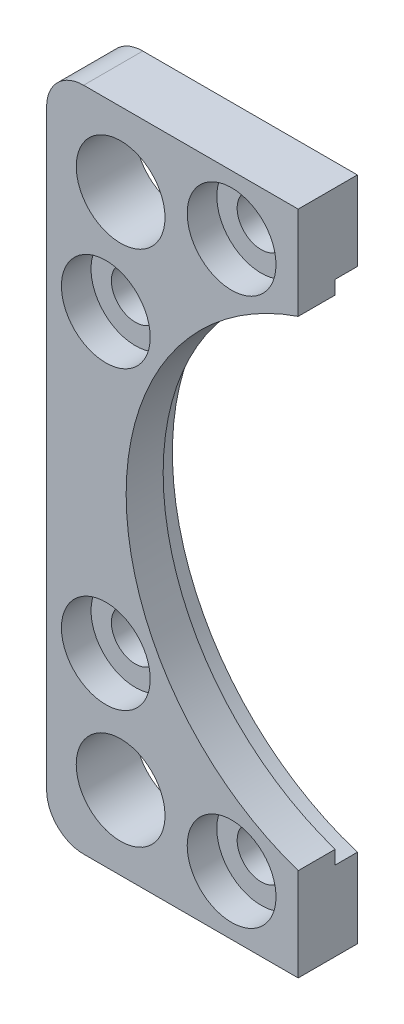
ISO-10303-21;
HEADER;
FILE_DESCRIPTION(('STEP AP214'),'2;1');
FILE_NAME('part.step','',(''),(''),'','','');
FILE_SCHEMA(('AUTOMOTIVE_DESIGN { 1 0 10303 214 1 1 1 1 }'));
ENDSEC;
DATA;
#1=APPLICATION_CONTEXT('core data for automotive mechanical design processes');
#2=APPLICATION_PROTOCOL_DEFINITION('international standard','automotive_design',2000,#1);
#3=PRODUCT_CONTEXT('',#1,'mechanical');
#4=PRODUCT('Part','Part','',(#3));
#5=PRODUCT_RELATED_PRODUCT_CATEGORY('part','',(#4));
#6=PRODUCT_DEFINITION_FORMATION('','',#4);
#7=PRODUCT_DEFINITION_CONTEXT('part definition',#1,'design');
#8=PRODUCT_DEFINITION('design','',#6,#7);
#9=PRODUCT_DEFINITION_SHAPE('','',#8);
#10=(LENGTH_UNIT() NAMED_UNIT(*) SI_UNIT(.MILLI.,.METRE.));
#11=(NAMED_UNIT(*) PLANE_ANGLE_UNIT() SI_UNIT($,.RADIAN.));
#12=(NAMED_UNIT(*) SI_UNIT($,.STERADIAN.) SOLID_ANGLE_UNIT());
#13=UNCERTAINTY_MEASURE_WITH_UNIT(LENGTH_MEASURE(1.E-05),#10,'distance_accuracy_value','');
#14=(GEOMETRIC_REPRESENTATION_CONTEXT(3) GLOBAL_UNCERTAINTY_ASSIGNED_CONTEXT((#13)) GLOBAL_UNIT_ASSIGNED_CONTEXT((#10,
#11,#12)) REPRESENTATION_CONTEXT('',''));
#15=CARTESIAN_POINT('',(0.,0.,0.));
#16=DIRECTION('',(0.,0.,1.));
#17=DIRECTION('',(1.,0.,0.));
#18=AXIS2_PLACEMENT_3D('',#15,#16,#17);
#19=CARTESIAN_POINT('',(-37.,20.,4.));
#20=DIRECTION('',(0.,0.,-1.));
#21=DIRECTION('',(-1.,0.,0.));
#22=AXIS2_PLACEMENT_3D('',#19,#20,#21);
#23=CYLINDRICAL_SURFACE('',#22,3.25);
#24=CARTESIAN_POINT('',(-37.,20.,-4.));
#25=DIRECTION('',(0.,0.,1.));
#26=DIRECTION('',(1.,0.,0.));
#27=AXIS2_PLACEMENT_3D('',#24,#25,#26);
#28=CIRCLE('',#27,3.25);
#29=CARTESIAN_POINT('',(-33.75,20.,-4.));
#30=VERTEX_POINT('',#29);
#31=EDGE_CURVE('E237',#30,#30,#28,.T.);
#32=ORIENTED_EDGE('',*,*,#31,.F.);
#33=EDGE_LOOP('',(#32));
#34=FACE_BOUND('',#33,.T.);
#35=CARTESIAN_POINT('',(-37.,20.,0.));
#36=DIRECTION('',(0.,0.,1.));
#37=DIRECTION('',(1.,0.,0.));
#38=AXIS2_PLACEMENT_3D('',#35,#36,#37);
#39=CIRCLE('',#38,3.25);
#40=CARTESIAN_POINT('',(-33.75,20.,0.));
#41=VERTEX_POINT('',#40);
#42=EDGE_CURVE('E38',#41,#41,#39,.T.);
#43=ORIENTED_EDGE('',*,*,#42,.T.);
#44=EDGE_LOOP('',(#43));
#45=FACE_BOUND('',#44,.T.);
#46=ADVANCED_FACE('F34',(#34,#45),#23,.F.);
#47=CARTESIAN_POINT('',(-20.,36.9999999999999,4.));
#48=DIRECTION('',(0.,0.,-1.));
#49=DIRECTION('',(-1.,0.,0.));
#50=AXIS2_PLACEMENT_3D('',#47,#48,#49);
#51=CYLINDRICAL_SURFACE('',#50,3.25);
#52=CARTESIAN_POINT('',(-20.,36.9999999999999,-4.));
#53=DIRECTION('',(0.,0.,1.));
#54=DIRECTION('',(1.,0.,0.));
#55=AXIS2_PLACEMENT_3D('',#52,#53,#54);
#56=CIRCLE('',#55,3.25);
#57=CARTESIAN_POINT('',(-16.75,36.9999999999999,-4.));
#58=VERTEX_POINT('',#57);
#59=EDGE_CURVE('E231',#58,#58,#56,.T.);
#60=ORIENTED_EDGE('',*,*,#59,.F.);
#61=EDGE_LOOP('',(#60));
#62=FACE_BOUND('',#61,.T.);
#63=CARTESIAN_POINT('',(-20.,36.9999999999999,0.));
#64=DIRECTION('',(0.,0.,1.));
#65=DIRECTION('',(1.,0.,0.));
#66=AXIS2_PLACEMENT_3D('',#63,#64,#65);
#67=CIRCLE('',#66,3.25);
#68=CARTESIAN_POINT('',(-16.75,36.9999999999999,0.));
#69=VERTEX_POINT('',#68);
#70=EDGE_CURVE('E181',#69,#69,#67,.T.);
#71=ORIENTED_EDGE('',*,*,#70,.T.);
#72=EDGE_LOOP('',(#71));
#73=FACE_BOUND('',#72,.T.);
#74=ADVANCED_FACE('F301',(#62,#73),#51,.F.);
#75=CARTESIAN_POINT('',(0.,0.,4.));
#76=DIRECTION('',(0.,0.,-1.));
#77=DIRECTION('',(-1.,0.,0.));
#78=AXIS2_PLACEMENT_3D('',#75,#76,#77);
#79=CYLINDRICAL_SURFACE('',#78,34.25);
#80=CARTESIAN_POINT('',(0.,0.,-1.));
#81=DIRECTION('',(0.,0.,-1.));
#82=DIRECTION('',(-1.,0.,0.));
#83=AXIS2_PLACEMENT_3D('',#80,#81,#82);
#84=CIRCLE('',#83,34.25);
#85=CARTESIAN_POINT('',(-11.,32.4355129449189,-1.));
#86=VERTEX_POINT('',#85);
#87=CARTESIAN_POINT('',(-11.,-32.4355129449189,-1.));
#88=VERTEX_POINT('',#87);
#89=EDGE_CURVE('E222',#86,#88,#84,.F.);
#90=ORIENTED_EDGE('',*,*,#89,.F.);
#91=DIRECTION('',(0.,0.,-1.));
#92=VECTOR('',#91,1.);
#93=CARTESIAN_POINT('',(-11.,32.4355129449189,4.));
#94=LINE('',#93,#92);
#95=CARTESIAN_POINT('',(-11.,32.4355129449189,4.));
#96=VERTEX_POINT('',#95);
#97=EDGE_CURVE('E155',#96,#86,#94,.T.);
#98=ORIENTED_EDGE('',*,*,#97,.F.);
#99=CARTESIAN_POINT('',(0.,0.,4.));
#100=DIRECTION('',(0.,0.,-1.));
#101=DIRECTION('',(1.,0.,0.));
#102=AXIS2_PLACEMENT_3D('',#99,#100,#101);
#103=CIRCLE('',#102,34.25);
#104=CARTESIAN_POINT('',(-11.,-32.4355129449189,4.));
#105=VERTEX_POINT('',#104);
#106=EDGE_CURVE('E255',#105,#96,#103,.T.);
#107=ORIENTED_EDGE('',*,*,#106,.F.);
#108=DIRECTION('',(0.,0.,-1.));
#109=VECTOR('',#108,1.);
#110=CARTESIAN_POINT('',(-11.,-32.4355129449189,4.));
#111=LINE('',#110,#109);
#112=EDGE_CURVE('E158',#105,#88,#111,.T.);
#113=ORIENTED_EDGE('',*,*,#112,.T.);
#114=EDGE_LOOP('',(#90,#98,#107,#113));
#115=FACE_BOUND('',#114,.T.);
#116=ADVANCED_FACE('F288',(#115),#79,.F.);
#117=CARTESIAN_POINT('',(0.,0.,4.));
#118=DIRECTION('',(0.,0.,1.));
#119=DIRECTION('',(1.,0.,0.));
#120=AXIS2_PLACEMENT_3D('',#117,#118,#119);
#121=PLANE('',#120);
#122=CARTESIAN_POINT('',(-20.,36.9999999999999,4.));
#123=DIRECTION('',(0.,0.,1.));
#124=DIRECTION('',(1.,0.,0.));
#125=AXIS2_PLACEMENT_3D('',#122,#123,#124);
#126=CIRCLE('',#125,6.);
#127=CARTESIAN_POINT('',(-14.,36.9999999999999,4.));
#128=VERTEX_POINT('',#127);
#129=EDGE_CURVE('E201',#128,#128,#126,.T.);
#130=ORIENTED_EDGE('',*,*,#129,.F.);
#131=EDGE_LOOP('',(#130));
#132=FACE_BOUND('',#131,.T.);
#133=CARTESIAN_POINT('',(-37.,20.,4.));
#134=DIRECTION('',(0.,0.,1.));
#135=DIRECTION('',(1.,0.,0.));
#136=AXIS2_PLACEMENT_3D('',#133,#134,#135);
#137=CIRCLE('',#136,6.);
#138=CARTESIAN_POINT('',(-31.,20.,4.));
#139=VERTEX_POINT('',#138);
#140=EDGE_CURVE('E202',#139,#139,#137,.T.);
#141=ORIENTED_EDGE('',*,*,#140,.F.);
#142=EDGE_LOOP('',(#141));
#143=FACE_BOUND('',#142,.T.);
#144=CARTESIAN_POINT('',(-37.,-20.,4.));
#145=DIRECTION('',(0.,0.,1.));
#146=DIRECTION('',(-1.,0.,0.));
#147=AXIS2_PLACEMENT_3D('',#144,#145,#146);
#148=CIRCLE('',#147,6.);
#149=CARTESIAN_POINT('',(-43.,-20.,4.));
#150=VERTEX_POINT('',#149);
#151=EDGE_CURVE('E213',#150,#150,#148,.T.);
#152=ORIENTED_EDGE('',*,*,#151,.F.);
#153=EDGE_LOOP('',(#152));
#154=FACE_BOUND('',#153,.T.);
#155=CARTESIAN_POINT('',(-20.,-36.9999999999999,4.));
#156=DIRECTION('',(0.,0.,1.));
#157=DIRECTION('',(-1.,0.,0.));
#158=AXIS2_PLACEMENT_3D('',#155,#156,#157);
#159=CIRCLE('',#158,6.);
#160=CARTESIAN_POINT('',(-26.,-36.9999999999999,4.));
#161=VERTEX_POINT('',#160);
#162=EDGE_CURVE('E219',#161,#161,#159,.T.);
#163=ORIENTED_EDGE('',*,*,#162,.F.);
#164=EDGE_LOOP('',(#163));
#165=FACE_BOUND('',#164,.T.);
#166=CARTESIAN_POINT('',(-35.,35.,4.));
#167=DIRECTION('',(0.,0.,1.));
#168=DIRECTION('',(1.,0.,0.));
#169=AXIS2_PLACEMENT_3D('',#166,#167,#168);
#170=CIRCLE('',#169,6.);
#171=CARTESIAN_POINT('',(-29.,35.,4.));
#172=VERTEX_POINT('',#171);
#173=EDGE_CURVE('E247',#172,#172,#170,.T.);
#174=ORIENTED_EDGE('',*,*,#173,.F.);
#175=EDGE_LOOP('',(#174));
#176=FACE_BOUND('',#175,.T.);
#177=DIRECTION('',(0.,-1.,0.));
#178=VECTOR('',#177,1.);
#179=CARTESIAN_POINT('',(-45.,45.,4.));
#180=LINE('',#179,#178);
#181=CARTESIAN_POINT('',(-45.,40.,4.));
#182=VERTEX_POINT('',#181);
#183=CARTESIAN_POINT('',(-45.,-40.,4.));
#184=VERTEX_POINT('',#183);
#185=EDGE_CURVE('E156',#182,#184,#180,.T.);
#186=ORIENTED_EDGE('',*,*,#185,.T.);
#187=CARTESIAN_POINT('',(-40.,-40.,4.));
#188=DIRECTION('',(0.,0.,1.));
#189=DIRECTION('',(1.,0.,0.));
#190=AXIS2_PLACEMENT_3D('',#187,#188,#189);
#191=CIRCLE('',#190,5.);
#192=CARTESIAN_POINT('',(-40.,-45.,4.));
#193=VERTEX_POINT('',#192);
#194=EDGE_CURVE('E43',#184,#193,#191,.T.);
#195=ORIENTED_EDGE('',*,*,#194,.T.);
#196=DIRECTION('',(1.,0.,0.));
#197=VECTOR('',#196,1.);
#198=CARTESIAN_POINT('',(-45.,-45.,4.));
#199=LINE('',#198,#197);
#200=CARTESIAN_POINT('',(-11.,-45.,4.));
#201=VERTEX_POINT('',#200);
#202=EDGE_CURVE('E152',#193,#201,#199,.T.);
#203=ORIENTED_EDGE('',*,*,#202,.T.);
#204=DIRECTION('',(0.,1.,0.));
#205=VECTOR('',#204,1.);
#206=CARTESIAN_POINT('',(-11.,-45.,4.));
#207=LINE('',#206,#205);
#208=EDGE_CURVE('E253',#201,#105,#207,.T.);
#209=ORIENTED_EDGE('',*,*,#208,.T.);
#210=ORIENTED_EDGE('',*,*,#106,.T.);
#211=DIRECTION('',(0.,1.,0.));
#212=VECTOR('',#211,1.);
#213=CARTESIAN_POINT('',(-11.,45.,4.));
#214=LINE('',#213,#212);
#215=CARTESIAN_POINT('',(-11.,45.,4.));
#216=VERTEX_POINT('',#215);
#217=EDGE_CURVE('E257',#96,#216,#214,.T.);
#218=ORIENTED_EDGE('',*,*,#217,.T.);
#219=DIRECTION('',(-1.,0.,0.));
#220=VECTOR('',#219,1.);
#221=CARTESIAN_POINT('',(-11.,45.,4.));
#222=LINE('',#221,#220);
#223=CARTESIAN_POINT('',(-40.,45.,4.));
#224=VERTEX_POINT('',#223);
#225=EDGE_CURVE('E259',#216,#224,#222,.T.);
#226=ORIENTED_EDGE('',*,*,#225,.T.);
#227=CARTESIAN_POINT('',(-40.,40.,4.));
#228=DIRECTION('',(0.,0.,1.));
#229=DIRECTION('',(1.,0.,0.));
#230=AXIS2_PLACEMENT_3D('',#227,#228,#229);
#231=CIRCLE('',#230,5.);
#232=EDGE_CURVE('E175',#224,#182,#231,.T.);
#233=ORIENTED_EDGE('',*,*,#232,.T.);
#234=EDGE_LOOP('',(#186,#195,#203,#209,#210,#218,#226,#233));
#235=FACE_BOUND('',#234,.T.);
#236=CARTESIAN_POINT('',(-35.,-35.,4.));
#237=DIRECTION('',(0.,0.,1.));
#238=DIRECTION('',(-1.,0.,0.));
#239=AXIS2_PLACEMENT_3D('',#236,#237,#238);
#240=CIRCLE('',#239,6.);
#241=CARTESIAN_POINT('',(-41.,-35.,4.));
#242=VERTEX_POINT('',#241);
#243=EDGE_CURVE('E241',#242,#242,#240,.T.);
#244=ORIENTED_EDGE('',*,*,#243,.F.);
#245=EDGE_LOOP('',(#244));
#246=FACE_BOUND('',#245,.T.);
#247=ADVANCED_FACE('F273',(#132,#143,#154,#165,#176,#235,#246),#121,.T.);
#248=CARTESIAN_POINT('',(0.,0.,-4.));
#249=DIRECTION('',(0.,0.,1.));
#250=DIRECTION('',(1.,0.,0.));
#251=AXIS2_PLACEMENT_3D('',#248,#249,#250);
#252=PLANE('',#251);
#253=DIRECTION('',(1.,0.,0.));
#254=VECTOR('',#253,1.);
#255=CARTESIAN_POINT('',(-45.,-45.,-4.));
#256=LINE('',#255,#254);
#257=CARTESIAN_POINT('',(-40.,-45.,-4.));
#258=VERTEX_POINT('',#257);
#259=CARTESIAN_POINT('',(-11.,-45.,-4.));
#260=VERTEX_POINT('',#259);
#261=EDGE_CURVE('E147',#258,#260,#256,.T.);
#262=ORIENTED_EDGE('',*,*,#261,.F.);
#263=CARTESIAN_POINT('',(-40.,-40.,-4.));
#264=DIRECTION('',(0.,0.,1.));
#265=DIRECTION('',(1.,0.,0.));
#266=AXIS2_PLACEMENT_3D('',#263,#264,#265);
#267=CIRCLE('',#266,5.);
#268=CARTESIAN_POINT('',(-45.,-40.,-4.));
#269=VERTEX_POINT('',#268);
#270=EDGE_CURVE('E169',#258,#269,#267,.F.);
#271=ORIENTED_EDGE('',*,*,#270,.T.);
#272=DIRECTION('',(0.,-1.,0.));
#273=VECTOR('',#272,1.);
#274=CARTESIAN_POINT('',(-45.,45.,-4.));
#275=LINE('',#274,#273);
#276=CARTESIAN_POINT('',(-45.,40.,-4.));
#277=VERTEX_POINT('',#276);
#278=EDGE_CURVE('E145',#277,#269,#275,.T.);
#279=ORIENTED_EDGE('',*,*,#278,.F.);
#280=CARTESIAN_POINT('',(-40.,40.,-4.));
#281=DIRECTION('',(0.,0.,1.));
#282=DIRECTION('',(1.,0.,0.));
#283=AXIS2_PLACEMENT_3D('',#280,#281,#282);
#284=CIRCLE('',#283,5.);
#285=CARTESIAN_POINT('',(-40.,45.,-4.));
#286=VERTEX_POINT('',#285);
#287=EDGE_CURVE('E167',#277,#286,#284,.F.);
#288=ORIENTED_EDGE('',*,*,#287,.T.);
#289=DIRECTION('',(-1.,0.,0.));
#290=VECTOR('',#289,1.);
#291=CARTESIAN_POINT('',(-11.,45.,-4.));
#292=LINE('',#291,#290);
#293=CARTESIAN_POINT('',(-11.,45.,-4.));
#294=VERTEX_POINT('',#293);
#295=EDGE_CURVE('E142',#294,#286,#292,.T.);
#296=ORIENTED_EDGE('',*,*,#295,.F.);
#297=DIRECTION('',(0.,1.,0.));
#298=VECTOR('',#297,1.);
#299=CARTESIAN_POINT('',(-11.,45.,-4.));
#300=LINE('',#299,#298);
#301=CARTESIAN_POINT('',(-11.,34.2782730020052,-4.));
#302=VERTEX_POINT('',#301);
#303=EDGE_CURVE('E132',#302,#294,#300,.T.);
#304=ORIENTED_EDGE('',*,*,#303,.F.);
#305=CARTESIAN_POINT('',(0.,0.,-4.));
#306=DIRECTION('',(0.,0.,-1.));
#307=DIRECTION('',(-1.,0.,0.));
#308=AXIS2_PLACEMENT_3D('',#305,#306,#307);
#309=CIRCLE('',#308,36.);
#310=CARTESIAN_POINT('',(-11.,-34.2782730020052,-4.));
#311=VERTEX_POINT('',#310);
#312=EDGE_CURVE('E115',#311,#302,#309,.T.);
#313=ORIENTED_EDGE('',*,*,#312,.F.);
#314=DIRECTION('',(0.,1.,0.));
#315=VECTOR('',#314,1.);
#316=CARTESIAN_POINT('',(-11.,-45.,-4.));
#317=LINE('',#316,#315);
#318=EDGE_CURVE('E143',#260,#311,#317,.T.);
#319=ORIENTED_EDGE('',*,*,#318,.F.);
#320=EDGE_LOOP('',(#262,#271,#279,#288,#296,#304,#313,#319));
#321=FACE_BOUND('',#320,.T.);
#322=CARTESIAN_POINT('',(-35.,35.,-4.));
#323=DIRECTION('',(0.,0.,1.));
#324=DIRECTION('',(1.,0.,0.));
#325=AXIS2_PLACEMENT_3D('',#322,#323,#324);
#326=CIRCLE('',#325,6.);
#327=CARTESIAN_POINT('',(-29.,35.,-4.));
#328=VERTEX_POINT('',#327);
#329=EDGE_CURVE('E244',#328,#328,#326,.T.);
#330=ORIENTED_EDGE('',*,*,#329,.T.);
#331=EDGE_LOOP('',(#330));
#332=FACE_BOUND('',#331,.T.);
#333=CARTESIAN_POINT('',(-35.,-35.,-4.));
#334=DIRECTION('',(0.,0.,1.));
#335=DIRECTION('',(-1.,0.,0.));
#336=AXIS2_PLACEMENT_3D('',#333,#334,#335);
#337=CIRCLE('',#336,6.);
#338=CARTESIAN_POINT('',(-41.,-35.,-4.));
#339=VERTEX_POINT('',#338);
#340=EDGE_CURVE('E240',#339,#339,#337,.T.);
#341=ORIENTED_EDGE('',*,*,#340,.T.);
#342=EDGE_LOOP('',(#341));
#343=FACE_BOUND('',#342,.T.);
#344=ORIENTED_EDGE('',*,*,#31,.T.);
#345=EDGE_LOOP('',(#344));
#346=FACE_BOUND('',#345,.T.);
#347=CARTESIAN_POINT('',(-37.,-20.,-4.));
#348=DIRECTION('',(0.,0.,1.));
#349=DIRECTION('',(-1.,0.,0.));
#350=AXIS2_PLACEMENT_3D('',#347,#348,#349);
#351=CIRCLE('',#350,3.25);
#352=CARTESIAN_POINT('',(-40.25,-20.,-4.));
#353=VERTEX_POINT('',#352);
#354=EDGE_CURVE('E234',#353,#353,#351,.T.);
#355=ORIENTED_EDGE('',*,*,#354,.T.);
#356=EDGE_LOOP('',(#355));
#357=FACE_BOUND('',#356,.T.);
#358=ORIENTED_EDGE('',*,*,#59,.T.);
#359=EDGE_LOOP('',(#358));
#360=FACE_BOUND('',#359,.T.);
#361=CARTESIAN_POINT('',(-20.,-36.9999999999999,-4.));
#362=DIRECTION('',(0.,0.,1.));
#363=DIRECTION('',(-1.,0.,0.));
#364=AXIS2_PLACEMENT_3D('',#361,#362,#363);
#365=CIRCLE('',#364,3.25);
#366=CARTESIAN_POINT('',(-23.25,-36.9999999999999,-4.));
#367=VERTEX_POINT('',#366);
#368=EDGE_CURVE('E228',#367,#367,#365,.T.);
#369=ORIENTED_EDGE('',*,*,#368,.T.);
#370=EDGE_LOOP('',(#369));
#371=FACE_BOUND('',#370,.T.);
#372=ADVANCED_FACE('F140',(#321,#332,#343,#346,#357,#360,#371),#252,.F.);
#373=CARTESIAN_POINT('',(-45.,-45.,4.));
#374=DIRECTION('',(0.,1.,0.));
#375=DIRECTION('',(0.,0.,1.));
#376=AXIS2_PLACEMENT_3D('',#373,#374,#375);
#377=PLANE('',#376);
#378=ORIENTED_EDGE('',*,*,#202,.F.);
#379=DIRECTION('',(0.,0.,-1.));
#380=VECTOR('',#379,1.);
#381=CARTESIAN_POINT('',(-40.,-45.,4.));
#382=LINE('',#381,#380);
#383=EDGE_CURVE('E136',#193,#258,#382,.T.);
#384=ORIENTED_EDGE('',*,*,#383,.T.);
#385=ORIENTED_EDGE('',*,*,#261,.T.);
#386=DIRECTION('',(0.,0.,-1.));
#387=VECTOR('',#386,1.);
#388=CARTESIAN_POINT('',(-11.,-45.,4.));
#389=LINE('',#388,#387);
#390=EDGE_CURVE('E161',#201,#260,#389,.T.);
#391=ORIENTED_EDGE('',*,*,#390,.F.);
#392=EDGE_LOOP('',(#378,#384,#385,#391));
#393=FACE_BOUND('',#392,.T.);
#394=ADVANCED_FACE('F264',(#393),#377,.F.);
#395=CARTESIAN_POINT('',(-11.,-45.,4.));
#396=DIRECTION('',(-1.,0.,0.));
#397=DIRECTION('',(0.,-1.,0.));
#398=AXIS2_PLACEMENT_3D('',#395,#396,#397);
#399=PLANE('',#398);
#400=ORIENTED_EDGE('',*,*,#318,.T.);
#401=DIRECTION('',(0.,0.,-1.));
#402=VECTOR('',#401,1.);
#403=CARTESIAN_POINT('',(-11.,-34.2782730020052,-1.));
#404=LINE('',#403,#402);
#405=CARTESIAN_POINT('',(-11.,-34.2782730020052,-1.));
#406=VERTEX_POINT('',#405);
#407=EDGE_CURVE('E122',#311,#406,#404,.F.);
#408=ORIENTED_EDGE('',*,*,#407,.T.);
#409=DIRECTION('',(0.,-1.,0.));
#410=VECTOR('',#409,1.);
#411=CARTESIAN_POINT('',(-11.,-45.,-1.));
#412=LINE('',#411,#410);
#413=EDGE_CURVE('E225',#88,#406,#412,.T.);
#414=ORIENTED_EDGE('',*,*,#413,.F.);
#415=ORIENTED_EDGE('',*,*,#112,.F.);
#416=ORIENTED_EDGE('',*,*,#208,.F.);
#417=ORIENTED_EDGE('',*,*,#390,.T.);
#418=EDGE_LOOP('',(#400,#408,#414,#415,#416,#417));
#419=FACE_BOUND('',#418,.T.);
#420=ADVANCED_FACE('F268',(#419),#399,.F.);
#421=CARTESIAN_POINT('',(-11.,45.,4.));
#422=DIRECTION('',(-1.,0.,0.));
#423=DIRECTION('',(0.,-1.,0.));
#424=AXIS2_PLACEMENT_3D('',#421,#422,#423);
#425=PLANE('',#424);
#426=DIRECTION('',(0.,-1.,0.));
#427=VECTOR('',#426,1.);
#428=CARTESIAN_POINT('',(-11.,45.,-1.));
#429=LINE('',#428,#427);
#430=CARTESIAN_POINT('',(-11.,34.2782730020052,-1.));
#431=VERTEX_POINT('',#430);
#432=EDGE_CURVE('E135',#431,#86,#429,.T.);
#433=ORIENTED_EDGE('',*,*,#432,.F.);
#434=DIRECTION('',(0.,0.,-1.));
#435=VECTOR('',#434,1.);
#436=CARTESIAN_POINT('',(-11.,34.2782730020052,-1.));
#437=LINE('',#436,#435);
#438=EDGE_CURVE('E119',#431,#302,#437,.T.);
#439=ORIENTED_EDGE('',*,*,#438,.T.);
#440=ORIENTED_EDGE('',*,*,#303,.T.);
#441=DIRECTION('',(0.,0.,-1.));
#442=VECTOR('',#441,1.);
#443=CARTESIAN_POINT('',(-11.,45.,4.));
#444=LINE('',#443,#442);
#445=EDGE_CURVE('E153',#216,#294,#444,.T.);
#446=ORIENTED_EDGE('',*,*,#445,.F.);
#447=ORIENTED_EDGE('',*,*,#217,.F.);
#448=ORIENTED_EDGE('',*,*,#97,.T.);
#449=EDGE_LOOP('',(#433,#439,#440,#446,#447,#448));
#450=FACE_BOUND('',#449,.T.);
#451=ADVANCED_FACE('F130',(#450),#425,.F.);
#452=CARTESIAN_POINT('',(-11.,45.,4.));
#453=DIRECTION('',(0.,-1.,0.));
#454=DIRECTION('',(0.,0.,-1.));
#455=AXIS2_PLACEMENT_3D('',#452,#453,#454);
#456=PLANE('',#455);
#457=ORIENTED_EDGE('',*,*,#295,.T.);
#458=DIRECTION('',(0.,0.,-1.));
#459=VECTOR('',#458,1.);
#460=CARTESIAN_POINT('',(-40.,45.,4.));
#461=LINE('',#460,#459);
#462=EDGE_CURVE('E11',#286,#224,#461,.F.);
#463=ORIENTED_EDGE('',*,*,#462,.T.);
#464=ORIENTED_EDGE('',*,*,#225,.F.);
#465=ORIENTED_EDGE('',*,*,#445,.T.);
#466=EDGE_LOOP('',(#457,#463,#464,#465));
#467=FACE_BOUND('',#466,.T.);
#468=ADVANCED_FACE('F284',(#467),#456,.F.);
#469=CARTESIAN_POINT('',(-45.,45.,4.));
#470=DIRECTION('',(1.,0.,0.));
#471=DIRECTION('',(0.,0.,-1.));
#472=AXIS2_PLACEMENT_3D('',#469,#470,#471);
#473=PLANE('',#472);
#474=ORIENTED_EDGE('',*,*,#278,.T.);
#475=DIRECTION('',(0.,0.,-1.));
#476=VECTOR('',#475,1.);
#477=CARTESIAN_POINT('',(-45.,-40.,4.));
#478=LINE('',#477,#476);
#479=EDGE_CURVE('E57',#269,#184,#478,.F.);
#480=ORIENTED_EDGE('',*,*,#479,.T.);
#481=ORIENTED_EDGE('',*,*,#185,.F.);
#482=DIRECTION('',(0.,0.,-1.));
#483=VECTOR('',#482,1.);
#484=CARTESIAN_POINT('',(-45.,40.,4.));
#485=LINE('',#484,#483);
#486=EDGE_CURVE('E171',#182,#277,#485,.T.);
#487=ORIENTED_EDGE('',*,*,#486,.T.);
#488=EDGE_LOOP('',(#474,#480,#481,#487));
#489=FACE_BOUND('',#488,.T.);
#490=ADVANCED_FACE('F280',(#489),#473,.F.);
#491=CARTESIAN_POINT('',(-35.,35.,4.));
#492=DIRECTION('',(0.,0.,-1.));
#493=DIRECTION('',(-1.,0.,0.));
#494=AXIS2_PLACEMENT_3D('',#491,#492,#493);
#495=CYLINDRICAL_SURFACE('',#494,6.);
#496=ORIENTED_EDGE('',*,*,#173,.T.);
#497=EDGE_LOOP('',(#496));
#498=FACE_BOUND('',#497,.T.);
#499=ORIENTED_EDGE('',*,*,#329,.F.);
#500=EDGE_LOOP('',(#499));
#501=FACE_BOUND('',#500,.T.);
#502=ADVANCED_FACE('F316',(#498,#501),#495,.F.);
#503=CARTESIAN_POINT('',(-35.,-35.,4.));
#504=DIRECTION('',(0.,0.,-1.));
#505=DIRECTION('',(-1.,0.,0.));
#506=AXIS2_PLACEMENT_3D('',#503,#504,#505);
#507=CYLINDRICAL_SURFACE('',#506,6.);
#508=ORIENTED_EDGE('',*,*,#243,.T.);
#509=EDGE_LOOP('',(#508));
#510=FACE_BOUND('',#509,.T.);
#511=ORIENTED_EDGE('',*,*,#340,.F.);
#512=EDGE_LOOP('',(#511));
#513=FACE_BOUND('',#512,.T.);
#514=ADVANCED_FACE('F313',(#510,#513),#507,.F.);
#515=CARTESIAN_POINT('',(-37.,-20.,4.));
#516=DIRECTION('',(0.,0.,-1.));
#517=DIRECTION('',(-1.,0.,0.));
#518=AXIS2_PLACEMENT_3D('',#515,#516,#517);
#519=CYLINDRICAL_SURFACE('',#518,3.25);
#520=CARTESIAN_POINT('',(-37.,-20.,0.));
#521=DIRECTION('',(0.,0.,-1.));
#522=DIRECTION('',(-1.,0.,0.));
#523=AXIS2_PLACEMENT_3D('',#520,#521,#522);
#524=CIRCLE('',#523,3.25);
#525=CARTESIAN_POINT('',(-40.25,-20.,0.));
#526=VERTEX_POINT('',#525);
#527=EDGE_CURVE('E184',#526,#526,#524,.T.);
#528=ORIENTED_EDGE('',*,*,#527,.F.);
#529=EDGE_LOOP('',(#528));
#530=FACE_BOUND('',#529,.T.);
#531=ORIENTED_EDGE('',*,*,#354,.F.);
#532=EDGE_LOOP('',(#531));
#533=FACE_BOUND('',#532,.T.);
#534=ADVANCED_FACE('F312',(#530,#533),#519,.F.);
#535=CARTESIAN_POINT('',(-20.,-36.9999999999999,4.));
#536=DIRECTION('',(0.,0.,-1.));
#537=DIRECTION('',(-1.,0.,0.));
#538=AXIS2_PLACEMENT_3D('',#535,#536,#537);
#539=CYLINDRICAL_SURFACE('',#538,3.25);
#540=CARTESIAN_POINT('',(-20.,-36.9999999999999,0.));
#541=DIRECTION('',(0.,0.,-1.));
#542=DIRECTION('',(-1.,0.,0.));
#543=AXIS2_PLACEMENT_3D('',#540,#541,#542);
#544=CIRCLE('',#543,3.25);
#545=CARTESIAN_POINT('',(-23.25,-36.9999999999999,0.));
#546=VERTEX_POINT('',#545);
#547=EDGE_CURVE('E178',#546,#546,#544,.T.);
#548=ORIENTED_EDGE('',*,*,#547,.F.);
#549=EDGE_LOOP('',(#548));
#550=FACE_BOUND('',#549,.T.);
#551=ORIENTED_EDGE('',*,*,#368,.F.);
#552=EDGE_LOOP('',(#551));
#553=FACE_BOUND('',#552,.T.);
#554=ADVANCED_FACE('F297',(#550,#553),#539,.F.);
#555=CARTESIAN_POINT('',(0.,0.,-1.));
#556=DIRECTION('',(0.,0.,-1.));
#557=DIRECTION('',(-1.,0.,0.));
#558=AXIS2_PLACEMENT_3D('',#555,#556,#557);
#559=CYLINDRICAL_SURFACE('',#558,36.);
#560=ORIENTED_EDGE('',*,*,#312,.T.);
#561=ORIENTED_EDGE('',*,*,#438,.F.);
#562=CARTESIAN_POINT('',(0.,0.,-1.));
#563=DIRECTION('',(0.,0.,-1.));
#564=DIRECTION('',(-1.,0.,0.));
#565=AXIS2_PLACEMENT_3D('',#562,#563,#564);
#566=CIRCLE('',#565,36.);
#567=EDGE_CURVE('E127',#406,#431,#566,.T.);
#568=ORIENTED_EDGE('',*,*,#567,.F.);
#569=ORIENTED_EDGE('',*,*,#407,.F.);
#570=EDGE_LOOP('',(#560,#561,#568,#569));
#571=FACE_BOUND('',#570,.T.);
#572=ADVANCED_FACE('F117',(#571),#559,.F.);
#573=CARTESIAN_POINT('',(0.,0.,-1.));
#574=DIRECTION('',(0.,0.,-1.));
#575=DIRECTION('',(-1.,0.,0.));
#576=AXIS2_PLACEMENT_3D('',#573,#574,#575);
#577=PLANE('',#576);
#578=ORIENTED_EDGE('',*,*,#413,.T.);
#579=ORIENTED_EDGE('',*,*,#567,.T.);
#580=ORIENTED_EDGE('',*,*,#432,.T.);
#581=ORIENTED_EDGE('',*,*,#89,.T.);
#582=EDGE_LOOP('',(#578,#579,#580,#581));
#583=FACE_BOUND('',#582,.T.);
#584=ADVANCED_FACE('F290',(#583),#577,.T.);
#585=CARTESIAN_POINT('',(-40.,-40.,4.));
#586=DIRECTION('',(0.,0.,-1.));
#587=DIRECTION('',(-1.,0.,0.));
#588=AXIS2_PLACEMENT_3D('',#585,#586,#587);
#589=CYLINDRICAL_SURFACE('',#588,5.);
#590=ORIENTED_EDGE('',*,*,#194,.F.);
#591=ORIENTED_EDGE('',*,*,#479,.F.);
#592=ORIENTED_EDGE('',*,*,#270,.F.);
#593=ORIENTED_EDGE('',*,*,#383,.F.);
#594=EDGE_LOOP('',(#590,#591,#592,#593));
#595=FACE_BOUND('',#594,.T.);
#596=ADVANCED_FACE('F278',(#595),#589,.T.);
#597=CARTESIAN_POINT('',(-40.,40.,4.));
#598=DIRECTION('',(0.,0.,-1.));
#599=DIRECTION('',(-1.,0.,0.));
#600=AXIS2_PLACEMENT_3D('',#597,#598,#599);
#601=CYLINDRICAL_SURFACE('',#600,5.);
#602=ORIENTED_EDGE('',*,*,#232,.F.);
#603=ORIENTED_EDGE('',*,*,#462,.F.);
#604=ORIENTED_EDGE('',*,*,#287,.F.);
#605=ORIENTED_EDGE('',*,*,#486,.F.);
#606=EDGE_LOOP('',(#602,#603,#604,#605));
#607=FACE_BOUND('',#606,.T.);
#608=ADVANCED_FACE('F36',(#607),#601,.T.);
#609=CARTESIAN_POINT('',(-20.,-36.9999999999999,0.));
#610=DIRECTION('',(0.,0.,1.));
#611=DIRECTION('',(1.,0.,0.));
#612=AXIS2_PLACEMENT_3D('',#609,#610,#611);
#613=CYLINDRICAL_SURFACE('',#612,6.);
#614=CARTESIAN_POINT('',(-20.,-36.9999999999999,0.));
#615=DIRECTION('',(0.,0.,1.));
#616=DIRECTION('',(-1.,0.,0.));
#617=AXIS2_PLACEMENT_3D('',#614,#615,#616);
#618=CIRCLE('',#617,6.);
#619=CARTESIAN_POINT('',(-26.,-36.9999999999999,0.));
#620=VERTEX_POINT('',#619);
#621=EDGE_CURVE('E216',#620,#620,#618,.T.);
#622=ORIENTED_EDGE('',*,*,#621,.F.);
#623=EDGE_LOOP('',(#622));
#624=FACE_BOUND('',#623,.T.);
#625=ORIENTED_EDGE('',*,*,#162,.T.);
#626=EDGE_LOOP('',(#625));
#627=FACE_BOUND('',#626,.T.);
#628=ADVANCED_FACE('F442',(#624,#627),#613,.F.);
#629=CARTESIAN_POINT('',(-20.,-36.9999999999999,0.));
#630=DIRECTION('',(0.,0.,-1.));
#631=DIRECTION('',(-1.,0.,0.));
#632=AXIS2_PLACEMENT_3D('',#629,#630,#631);
#633=PLANE('',#632);
#634=ORIENTED_EDGE('',*,*,#547,.T.);
#635=EDGE_LOOP('',(#634));
#636=FACE_BOUND('',#635,.T.);
#637=ORIENTED_EDGE('',*,*,#621,.T.);
#638=EDGE_LOOP('',(#637));
#639=FACE_BOUND('',#638,.T.);
#640=ADVANCED_FACE('F453',(#636,#639),#633,.F.);
#641=CARTESIAN_POINT('',(-20.,36.9999999999999,0.));
#642=DIRECTION('',(0.,0.,1.));
#643=DIRECTION('',(1.,0.,0.));
#644=AXIS2_PLACEMENT_3D('',#641,#642,#643);
#645=CYLINDRICAL_SURFACE('',#644,6.);
#646=CARTESIAN_POINT('',(-20.,36.9999999999999,0.));
#647=DIRECTION('',(0.,0.,1.));
#648=DIRECTION('',(1.,0.,0.));
#649=AXIS2_PLACEMENT_3D('',#646,#647,#648);
#650=CIRCLE('',#649,6.);
#651=CARTESIAN_POINT('',(-14.,36.9999999999999,0.));
#652=VERTEX_POINT('',#651);
#653=EDGE_CURVE('E182',#652,#652,#650,.T.);
#654=ORIENTED_EDGE('',*,*,#653,.F.);
#655=EDGE_LOOP('',(#654));
#656=FACE_BOUND('',#655,.T.);
#657=ORIENTED_EDGE('',*,*,#129,.T.);
#658=EDGE_LOOP('',(#657));
#659=FACE_BOUND('',#658,.T.);
#660=ADVANCED_FACE('F459',(#656,#659),#645,.F.);
#661=CARTESIAN_POINT('',(-20.,36.9999999999999,0.));
#662=DIRECTION('',(0.,0.,1.));
#663=DIRECTION('',(1.,0.,0.));
#664=AXIS2_PLACEMENT_3D('',#661,#662,#663);
#665=PLANE('',#664);
#666=ORIENTED_EDGE('',*,*,#70,.F.);
#667=EDGE_LOOP('',(#666));
#668=FACE_BOUND('',#667,.T.);
#669=ORIENTED_EDGE('',*,*,#653,.T.);
#670=EDGE_LOOP('',(#669));
#671=FACE_BOUND('',#670,.T.);
#672=ADVANCED_FACE('F467',(#668,#671),#665,.T.);
#673=CARTESIAN_POINT('',(-37.,-20.,0.));
#674=DIRECTION('',(0.,0.,1.));
#675=DIRECTION('',(1.,0.,0.));
#676=AXIS2_PLACEMENT_3D('',#673,#674,#675);
#677=CYLINDRICAL_SURFACE('',#676,6.);
#678=CARTESIAN_POINT('',(-37.,-20.,0.));
#679=DIRECTION('',(0.,0.,1.));
#680=DIRECTION('',(-1.,0.,0.));
#681=AXIS2_PLACEMENT_3D('',#678,#679,#680);
#682=CIRCLE('',#681,6.);
#683=CARTESIAN_POINT('',(-43.,-20.,0.));
#684=VERTEX_POINT('',#683);
#685=EDGE_CURVE('E207',#684,#684,#682,.T.);
#686=ORIENTED_EDGE('',*,*,#685,.F.);
#687=EDGE_LOOP('',(#686));
#688=FACE_BOUND('',#687,.T.);
#689=ORIENTED_EDGE('',*,*,#151,.T.);
#690=EDGE_LOOP('',(#689));
#691=FACE_BOUND('',#690,.T.);
#692=ADVANCED_FACE('F475',(#688,#691),#677,.F.);
#693=CARTESIAN_POINT('',(-37.,-20.,0.));
#694=DIRECTION('',(0.,0.,-1.));
#695=DIRECTION('',(-1.,0.,0.));
#696=AXIS2_PLACEMENT_3D('',#693,#694,#695);
#697=PLANE('',#696);
#698=ORIENTED_EDGE('',*,*,#527,.T.);
#699=EDGE_LOOP('',(#698));
#700=FACE_BOUND('',#699,.T.);
#701=ORIENTED_EDGE('',*,*,#685,.T.);
#702=EDGE_LOOP('',(#701));
#703=FACE_BOUND('',#702,.T.);
#704=ADVANCED_FACE('F483',(#700,#703),#697,.F.);
#705=CARTESIAN_POINT('',(-37.,20.,0.));
#706=DIRECTION('',(0.,0.,1.));
#707=DIRECTION('',(1.,0.,0.));
#708=AXIS2_PLACEMENT_3D('',#705,#706,#707);
#709=CYLINDRICAL_SURFACE('',#708,6.);
#710=CARTESIAN_POINT('',(-37.,20.,0.));
#711=DIRECTION('',(0.,0.,1.));
#712=DIRECTION('',(1.,0.,0.));
#713=AXIS2_PLACEMENT_3D('',#710,#711,#712);
#714=CIRCLE('',#713,6.);
#715=CARTESIAN_POINT('',(-31.,20.,0.));
#716=VERTEX_POINT('',#715);
#717=EDGE_CURVE('E199',#716,#716,#714,.T.);
#718=ORIENTED_EDGE('',*,*,#717,.F.);
#719=EDGE_LOOP('',(#718));
#720=FACE_BOUND('',#719,.T.);
#721=ORIENTED_EDGE('',*,*,#140,.T.);
#722=EDGE_LOOP('',(#721));
#723=FACE_BOUND('',#722,.T.);
#724=ADVANCED_FACE('F195',(#720,#723),#709,.F.);
#725=CARTESIAN_POINT('',(-37.,20.,0.));
#726=DIRECTION('',(0.,0.,1.));
#727=DIRECTION('',(1.,0.,0.));
#728=AXIS2_PLACEMENT_3D('',#725,#726,#727);
#729=PLANE('',#728);
#730=ORIENTED_EDGE('',*,*,#42,.F.);
#731=EDGE_LOOP('',(#730));
#732=FACE_BOUND('',#731,.T.);
#733=ORIENTED_EDGE('',*,*,#717,.T.);
#734=EDGE_LOOP('',(#733));
#735=FACE_BOUND('',#734,.T.);
#736=ADVANCED_FACE('F192',(#732,#735),#729,.T.);
#737=CLOSED_SHELL('',(#46,#74,#116,#247,#372,#394,#420,#451,#468,#490,#502,#514,#534,#554,#572,
#584,#596,#608,#628,#640,#660,#672,#692,#704,#724,#736));
#738=MANIFOLD_SOLID_BREP('B2',#737);
#739=ADVANCED_BREP_SHAPE_REPRESENTATION('',(#18,#738),#14);
#740=SHAPE_DEFINITION_REPRESENTATION(#9,#739);
ENDSEC;
END-ISO-10303-21;
